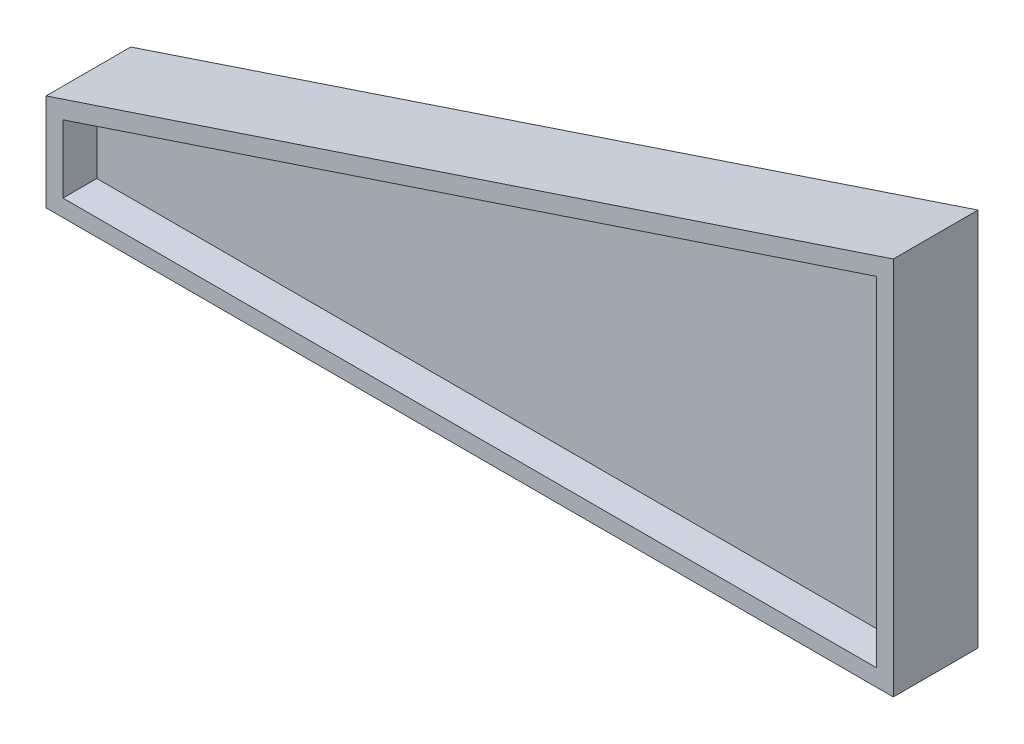
ISO-10303-21;
HEADER;
FILE_DESCRIPTION(('STEP AP214'),'2;1');
FILE_NAME('part.step','',(''),(''),'','','');
FILE_SCHEMA(('AUTOMOTIVE_DESIGN { 1 0 10303 214 1 1 1 1 }'));
ENDSEC;
DATA;
#1=APPLICATION_CONTEXT('core data for automotive mechanical design processes');
#2=APPLICATION_PROTOCOL_DEFINITION('international standard','automotive_design',2000,#1);
#3=PRODUCT_CONTEXT('',#1,'mechanical');
#4=PRODUCT('Part','Part','',(#3));
#5=PRODUCT_RELATED_PRODUCT_CATEGORY('part','',(#4));
#6=PRODUCT_DEFINITION_FORMATION('','',#4);
#7=PRODUCT_DEFINITION_CONTEXT('part definition',#1,'design');
#8=PRODUCT_DEFINITION('design','',#6,#7);
#9=PRODUCT_DEFINITION_SHAPE('','',#8);
#10=(LENGTH_UNIT() NAMED_UNIT(*) SI_UNIT(.MILLI.,.METRE.));
#11=(NAMED_UNIT(*) PLANE_ANGLE_UNIT() SI_UNIT($,.RADIAN.));
#12=(NAMED_UNIT(*) SI_UNIT($,.STERADIAN.) SOLID_ANGLE_UNIT());
#13=UNCERTAINTY_MEASURE_WITH_UNIT(LENGTH_MEASURE(1.E-05),#10,'distance_accuracy_value','');
#14=(GEOMETRIC_REPRESENTATION_CONTEXT(3) GLOBAL_UNCERTAINTY_ASSIGNED_CONTEXT((#13)) GLOBAL_UNIT_ASSIGNED_CONTEXT((#10,
#11,#12)) REPRESENTATION_CONTEXT('',''));
#15=CARTESIAN_POINT('',(0.,0.,0.));
#16=DIRECTION('',(0.,0.,1.));
#17=DIRECTION('',(1.,0.,0.));
#18=AXIS2_PLACEMENT_3D('',#15,#16,#17);
#19=CARTESIAN_POINT('',(0.,0.,12.7));
#20=DIRECTION('',(0.,0.,1.));
#21=DIRECTION('',(1.,0.,0.));
#22=AXIS2_PLACEMENT_3D('',#19,#20,#21);
#23=PLANE('',#22);
#24=DIRECTION('',(1.,0.,0.));
#25=VECTOR('',#24,1.);
#26=CARTESIAN_POINT('',(-609.6,0.,12.7));
#27=LINE('',#26,#25);
#28=CARTESIAN_POINT('',(-609.6,0.,12.7));
#29=VERTEX_POINT('',#28);
#30=CARTESIAN_POINT('',(0.,0.,12.7));
#31=VERTEX_POINT('',#30);
#32=EDGE_CURVE('E123',#29,#31,#27,.T.);
#33=ORIENTED_EDGE('',*,*,#32,.T.);
#34=DIRECTION('',(0.,1.,0.));
#35=VECTOR('',#34,1.);
#36=CARTESIAN_POINT('',(0.,0.,12.7));
#37=LINE('',#36,#35);
#38=CARTESIAN_POINT('',(0.,254.,12.7));
#39=VERTEX_POINT('',#38);
#40=EDGE_CURVE('E126',#31,#39,#37,.T.);
#41=ORIENTED_EDGE('',*,*,#40,.T.);
#42=DIRECTION('',(-0.948683298050514,-0.316227766016838,0.));
#43=VECTOR('',#42,1.);
#44=CARTESIAN_POINT('',(0.,254.,12.7));
#45=LINE('',#44,#43);
#46=CARTESIAN_POINT('',(-609.6,50.8,12.7));
#47=VERTEX_POINT('',#46);
#48=EDGE_CURVE('E43',#39,#47,#45,.T.);
#49=ORIENTED_EDGE('',*,*,#48,.T.);
#50=DIRECTION('',(0.,-1.,0.));
#51=VECTOR('',#50,1.);
#52=CARTESIAN_POINT('',(-609.6,50.8,12.7));
#53=LINE('',#52,#51);
#54=EDGE_CURVE('E11',#47,#29,#53,.T.);
#55=ORIENTED_EDGE('',*,*,#54,.T.);
#56=EDGE_LOOP('',(#33,#41,#49,#55));
#57=FACE_BOUND('',#56,.T.);
#58=ADVANCED_FACE('F33',(#57),#23,.T.);
#59=CARTESIAN_POINT('',(0.,0.,-25.4));
#60=DIRECTION('',(1.,0.,0.));
#61=DIRECTION('',(0.,0.,-1.));
#62=AXIS2_PLACEMENT_3D('',#59,#60,#61);
#63=PLANE('',#62);
#64=DIRECTION('',(0.,0.,1.));
#65=VECTOR('',#64,1.);
#66=CARTESIAN_POINT('',(0.,0.,-25.4));
#67=LINE('',#66,#65);
#68=CARTESIAN_POINT('',(0.,0.,-25.4));
#69=VERTEX_POINT('',#68);
#70=CARTESIAN_POINT('',(0.,0.,0.));
#71=VERTEX_POINT('',#70);
#72=EDGE_CURVE('E84',#69,#71,#67,.T.);
#73=ORIENTED_EDGE('',*,*,#72,.T.);
#74=DIRECTION('',(0.,1.,0.));
#75=VECTOR('',#74,1.);
#76=CARTESIAN_POINT('',(0.,0.,0.));
#77=LINE('',#76,#75);
#78=CARTESIAN_POINT('',(0.,254.,0.));
#79=VERTEX_POINT('',#78);
#80=EDGE_CURVE('E67',#71,#79,#77,.T.);
#81=ORIENTED_EDGE('',*,*,#80,.T.);
#82=DIRECTION('',(0.,0.,1.));
#83=VECTOR('',#82,1.);
#84=CARTESIAN_POINT('',(0.,254.,-25.4));
#85=LINE('',#84,#83);
#86=CARTESIAN_POINT('',(0.,254.,-25.4));
#87=VERTEX_POINT('',#86);
#88=EDGE_CURVE('E81',#87,#79,#85,.T.);
#89=ORIENTED_EDGE('',*,*,#88,.F.);
#90=DIRECTION('',(0.,1.,0.));
#91=VECTOR('',#90,1.);
#92=CARTESIAN_POINT('',(0.,0.,-25.4));
#93=LINE('',#92,#91);
#94=EDGE_CURVE('E163',#69,#87,#93,.T.);
#95=ORIENTED_EDGE('',*,*,#94,.F.);
#96=EDGE_LOOP('',(#73,#81,#89,#95));
#97=FACE_BOUND('',#96,.T.);
#98=ADVANCED_FACE('F78',(#97),#63,.F.);
#99=CARTESIAN_POINT('',(-609.6,0.,-25.4));
#100=DIRECTION('',(0.,-1.,0.));
#101=DIRECTION('',(0.,0.,-1.));
#102=AXIS2_PLACEMENT_3D('',#99,#100,#101);
#103=PLANE('',#102);
#104=DIRECTION('',(0.,0.,1.));
#105=VECTOR('',#104,1.);
#106=CARTESIAN_POINT('',(-609.6,0.,-25.4));
#107=LINE('',#106,#105);
#108=CARTESIAN_POINT('',(-609.6,0.,-25.4));
#109=VERTEX_POINT('',#108);
#110=CARTESIAN_POINT('',(-609.6,0.,0.));
#111=VERTEX_POINT('',#110);
#112=EDGE_CURVE('E137',#109,#111,#107,.T.);
#113=ORIENTED_EDGE('',*,*,#112,.T.);
#114=DIRECTION('',(1.,0.,0.));
#115=VECTOR('',#114,1.);
#116=CARTESIAN_POINT('',(-609.6,0.,0.));
#117=LINE('',#116,#115);
#118=EDGE_CURVE('E85',#111,#71,#117,.T.);
#119=ORIENTED_EDGE('',*,*,#118,.T.);
#120=ORIENTED_EDGE('',*,*,#72,.F.);
#121=DIRECTION('',(1.,0.,0.));
#122=VECTOR('',#121,1.);
#123=CARTESIAN_POINT('',(-609.6,0.,-25.4));
#124=LINE('',#123,#122);
#125=EDGE_CURVE('E96',#109,#69,#124,.T.);
#126=ORIENTED_EDGE('',*,*,#125,.F.);
#127=EDGE_LOOP('',(#113,#119,#120,#126));
#128=FACE_BOUND('',#127,.T.);
#129=ADVANCED_FACE('F133',(#128),#103,.F.);
#130=CARTESIAN_POINT('',(-609.6,50.8,-25.4));
#131=DIRECTION('',(-1.,0.,0.));
#132=DIRECTION('',(0.,0.,1.));
#133=AXIS2_PLACEMENT_3D('',#130,#131,#132);
#134=PLANE('',#133);
#135=DIRECTION('',(0.,0.,1.));
#136=VECTOR('',#135,1.);
#137=CARTESIAN_POINT('',(-609.6,50.8,-25.4));
#138=LINE('',#137,#136);
#139=CARTESIAN_POINT('',(-609.6,50.8,-25.4));
#140=VERTEX_POINT('',#139);
#141=CARTESIAN_POINT('',(-609.6,50.8,0.));
#142=VERTEX_POINT('',#141);
#143=EDGE_CURVE('E93',#140,#142,#138,.T.);
#144=ORIENTED_EDGE('',*,*,#143,.T.);
#145=DIRECTION('',(0.,-1.,0.));
#146=VECTOR('',#145,1.);
#147=CARTESIAN_POINT('',(-609.6,50.8,0.));
#148=LINE('',#147,#146);
#149=EDGE_CURVE('E37',#142,#111,#148,.T.);
#150=ORIENTED_EDGE('',*,*,#149,.T.);
#151=ORIENTED_EDGE('',*,*,#112,.F.);
#152=DIRECTION('',(0.,-1.,0.));
#153=VECTOR('',#152,1.);
#154=CARTESIAN_POINT('',(-609.6,50.8,-25.4));
#155=LINE('',#154,#153);
#156=EDGE_CURVE('E144',#140,#109,#155,.T.);
#157=ORIENTED_EDGE('',*,*,#156,.F.);
#158=EDGE_LOOP('',(#144,#150,#151,#157));
#159=FACE_BOUND('',#158,.T.);
#160=ADVANCED_FACE('F139',(#159),#134,.F.);
#161=CARTESIAN_POINT('',(0.,254.,-25.4));
#162=DIRECTION('',(-0.316227766016838,0.948683298050514,0.));
#163=DIRECTION('',(-0.948683298050514,-0.316227766016838,0.));
#164=AXIS2_PLACEMENT_3D('',#161,#162,#163);
#165=PLANE('',#164);
#166=ORIENTED_EDGE('',*,*,#88,.T.);
#167=DIRECTION('',(-0.948683298050514,-0.316227766016838,0.));
#168=VECTOR('',#167,1.);
#169=CARTESIAN_POINT('',(0.,254.,0.));
#170=LINE('',#169,#168);
#171=EDGE_CURVE('E65',#79,#142,#170,.T.);
#172=ORIENTED_EDGE('',*,*,#171,.T.);
#173=ORIENTED_EDGE('',*,*,#143,.F.);
#174=DIRECTION('',(-0.948683298050514,-0.316227766016838,0.));
#175=VECTOR('',#174,1.);
#176=CARTESIAN_POINT('',(0.,254.,-25.4));
#177=LINE('',#176,#175);
#178=EDGE_CURVE('E89',#87,#140,#177,.T.);
#179=ORIENTED_EDGE('',*,*,#178,.F.);
#180=EDGE_LOOP('',(#166,#172,#173,#179));
#181=FACE_BOUND('',#180,.T.);
#182=ADVANCED_FACE('F87',(#181),#165,.F.);
#183=CARTESIAN_POINT('',(-622.3,-12.7,-25.4));
#184=DIRECTION('',(0.,-1.,0.));
#185=DIRECTION('',(0.,0.,-1.));
#186=AXIS2_PLACEMENT_3D('',#183,#184,#185);
#187=PLANE('',#186);
#188=DIRECTION('',(0.,0.,1.));
#189=VECTOR('',#188,1.);
#190=CARTESIAN_POINT('',(12.7,-12.7,-25.4));
#191=LINE('',#190,#189);
#192=CARTESIAN_POINT('',(12.7,-12.7,-25.4));
#193=VERTEX_POINT('',#192);
#194=CARTESIAN_POINT('',(12.7,-12.7,38.1));
#195=VERTEX_POINT('',#194);
#196=EDGE_CURVE('E111',#193,#195,#191,.T.);
#197=ORIENTED_EDGE('',*,*,#196,.T.);
#198=DIRECTION('',(1.,0.,0.));
#199=VECTOR('',#198,1.);
#200=CARTESIAN_POINT('',(-622.3,-12.7,38.1));
#201=LINE('',#200,#199);
#202=CARTESIAN_POINT('',(-622.3,-12.7,38.1));
#203=VERTEX_POINT('',#202);
#204=EDGE_CURVE('E174',#203,#195,#201,.T.);
#205=ORIENTED_EDGE('',*,*,#204,.F.);
#206=DIRECTION('',(0.,0.,1.));
#207=VECTOR('',#206,1.);
#208=CARTESIAN_POINT('',(-622.3,-12.7,-25.4));
#209=LINE('',#208,#207);
#210=CARTESIAN_POINT('',(-622.3,-12.7,-25.4));
#211=VERTEX_POINT('',#210);
#212=EDGE_CURVE('E112',#211,#203,#209,.T.);
#213=ORIENTED_EDGE('',*,*,#212,.F.);
#214=DIRECTION('',(1.,0.,0.));
#215=VECTOR('',#214,1.);
#216=CARTESIAN_POINT('',(-622.3,-12.7,-25.4));
#217=LINE('',#216,#215);
#218=EDGE_CURVE('E99',#211,#193,#217,.T.);
#219=ORIENTED_EDGE('',*,*,#218,.T.);
#220=EDGE_LOOP('',(#197,#205,#213,#219));
#221=FACE_BOUND('',#220,.T.);
#222=ADVANCED_FACE('F249',(#221),#187,.T.);
#223=CARTESIAN_POINT('',(-622.3,59.9536420947128,-25.4));
#224=DIRECTION('',(-1.,0.,0.));
#225=DIRECTION('',(0.,0.,1.));
#226=AXIS2_PLACEMENT_3D('',#223,#224,#225);
#227=PLANE('',#226);
#228=ORIENTED_EDGE('',*,*,#212,.T.);
#229=DIRECTION('',(0.,-1.,0.));
#230=VECTOR('',#229,1.);
#231=CARTESIAN_POINT('',(-622.3,59.9536420947128,38.1));
#232=LINE('',#231,#230);
#233=CARTESIAN_POINT('',(-622.3,59.9536420947128,38.1));
#234=VERTEX_POINT('',#233);
#235=EDGE_CURVE('E165',#234,#203,#232,.T.);
#236=ORIENTED_EDGE('',*,*,#235,.F.);
#237=DIRECTION('',(0.,0.,1.));
#238=VECTOR('',#237,1.);
#239=CARTESIAN_POINT('',(-622.3,59.9536420947128,-25.4));
#240=LINE('',#239,#238);
#241=CARTESIAN_POINT('',(-622.3,59.9536420947128,-25.4));
#242=VERTEX_POINT('',#241);
#243=EDGE_CURVE('E115',#242,#234,#240,.T.);
#244=ORIENTED_EDGE('',*,*,#243,.F.);
#245=DIRECTION('',(0.,-1.,0.));
#246=VECTOR('',#245,1.);
#247=CARTESIAN_POINT('',(-622.3,59.9536420947128,-25.4));
#248=LINE('',#247,#246);
#249=EDGE_CURVE('E108',#242,#211,#248,.T.);
#250=ORIENTED_EDGE('',*,*,#249,.T.);
#251=EDGE_LOOP('',(#228,#236,#244,#250));
#252=FACE_BOUND('',#251,.T.);
#253=ADVANCED_FACE('F252',(#252),#227,.T.);
#254=CARTESIAN_POINT('',(12.7,271.620308761379,-25.4));
#255=DIRECTION('',(-0.316227766016838,0.948683298050514,0.));
#256=DIRECTION('',(-0.948683298050514,-0.316227766016838,0.));
#257=AXIS2_PLACEMENT_3D('',#254,#255,#256);
#258=PLANE('',#257);
#259=ORIENTED_EDGE('',*,*,#243,.T.);
#260=DIRECTION('',(-0.948683298050514,-0.316227766016838,0.));
#261=VECTOR('',#260,1.);
#262=CARTESIAN_POINT('',(12.7,271.620308761379,38.1));
#263=LINE('',#262,#261);
#264=CARTESIAN_POINT('',(12.7,271.620308761379,38.1));
#265=VERTEX_POINT('',#264);
#266=EDGE_CURVE('E168',#265,#234,#263,.T.);
#267=ORIENTED_EDGE('',*,*,#266,.F.);
#268=DIRECTION('',(0.,0.,1.));
#269=VECTOR('',#268,1.);
#270=CARTESIAN_POINT('',(12.7,271.620308761379,-25.4));
#271=LINE('',#270,#269);
#272=CARTESIAN_POINT('',(12.7,271.620308761379,-25.4));
#273=VERTEX_POINT('',#272);
#274=EDGE_CURVE('E118',#273,#265,#271,.T.);
#275=ORIENTED_EDGE('',*,*,#274,.F.);
#276=DIRECTION('',(-0.948683298050514,-0.316227766016838,0.));
#277=VECTOR('',#276,1.);
#278=CARTESIAN_POINT('',(12.7,271.620308761379,-25.4));
#279=LINE('',#278,#277);
#280=EDGE_CURVE('E105',#273,#242,#279,.T.);
#281=ORIENTED_EDGE('',*,*,#280,.T.);
#282=EDGE_LOOP('',(#259,#267,#275,#281));
#283=FACE_BOUND('',#282,.T.);
#284=ADVANCED_FACE('F258',(#283),#258,.T.);
#285=CARTESIAN_POINT('',(12.7,-12.7,-25.4));
#286=DIRECTION('',(1.,0.,0.));
#287=DIRECTION('',(0.,0.,-1.));
#288=AXIS2_PLACEMENT_3D('',#285,#286,#287);
#289=PLANE('',#288);
#290=ORIENTED_EDGE('',*,*,#274,.T.);
#291=DIRECTION('',(0.,1.,0.));
#292=VECTOR('',#291,1.);
#293=CARTESIAN_POINT('',(12.7,-12.7,38.1));
#294=LINE('',#293,#292);
#295=EDGE_CURVE('E171',#195,#265,#294,.T.);
#296=ORIENTED_EDGE('',*,*,#295,.F.);
#297=ORIENTED_EDGE('',*,*,#196,.F.);
#298=DIRECTION('',(0.,1.,0.));
#299=VECTOR('',#298,1.);
#300=CARTESIAN_POINT('',(12.7,-12.7,-25.4));
#301=LINE('',#300,#299);
#302=EDGE_CURVE('E102',#193,#273,#301,.T.);
#303=ORIENTED_EDGE('',*,*,#302,.T.);
#304=EDGE_LOOP('',(#290,#296,#297,#303));
#305=FACE_BOUND('',#304,.T.);
#306=ADVANCED_FACE('F254',(#305),#289,.T.);
#307=CARTESIAN_POINT('',(0.,0.,-25.4));
#308=DIRECTION('',(0.,0.,1.));
#309=DIRECTION('',(1.,0.,0.));
#310=AXIS2_PLACEMENT_3D('',#307,#308,#309);
#311=PLANE('',#310);
#312=ORIENTED_EDGE('',*,*,#125,.T.);
#313=ORIENTED_EDGE('',*,*,#94,.T.);
#314=ORIENTED_EDGE('',*,*,#178,.T.);
#315=ORIENTED_EDGE('',*,*,#156,.T.);
#316=EDGE_LOOP('',(#312,#313,#314,#315));
#317=FACE_BOUND('',#316,.T.);
#318=ORIENTED_EDGE('',*,*,#218,.F.);
#319=ORIENTED_EDGE('',*,*,#249,.F.);
#320=ORIENTED_EDGE('',*,*,#280,.F.);
#321=ORIENTED_EDGE('',*,*,#302,.F.);
#322=EDGE_LOOP('',(#318,#319,#320,#321));
#323=FACE_BOUND('',#322,.T.);
#324=ADVANCED_FACE('F257',(#317,#323),#311,.F.);
#325=ORIENTED_EDGE('',*,*,#40,.F.);
#326=CARTESIAN_POINT('',(0.,0.,38.1));
#327=VERTEX_POINT('',#326);
#328=EDGE_CURVE('E156',#31,#327,#67,.T.);
#329=ORIENTED_EDGE('',*,*,#328,.T.);
#330=DIRECTION('',(0.,1.,0.));
#331=VECTOR('',#330,1.);
#332=CARTESIAN_POINT('',(0.,0.,38.1));
#333=LINE('',#332,#331);
#334=CARTESIAN_POINT('',(0.,254.,38.1));
#335=VERTEX_POINT('',#334);
#336=EDGE_CURVE('E183',#327,#335,#333,.T.);
#337=ORIENTED_EDGE('',*,*,#336,.T.);
#338=EDGE_CURVE('E91',#39,#335,#85,.T.);
#339=ORIENTED_EDGE('',*,*,#338,.F.);
#340=EDGE_LOOP('',(#325,#329,#337,#339));
#341=FACE_BOUND('',#340,.T.);
#342=ADVANCED_FACE('F192',(#341),#63,.F.);
#343=ORIENTED_EDGE('',*,*,#32,.F.);
#344=CARTESIAN_POINT('',(-609.6,0.,38.1));
#345=VERTEX_POINT('',#344);
#346=EDGE_CURVE('E148',#29,#345,#107,.T.);
#347=ORIENTED_EDGE('',*,*,#346,.T.);
#348=DIRECTION('',(1.,0.,0.));
#349=VECTOR('',#348,1.);
#350=CARTESIAN_POINT('',(-609.6,0.,38.1));
#351=LINE('',#350,#349);
#352=EDGE_CURVE('E177',#345,#327,#351,.T.);
#353=ORIENTED_EDGE('',*,*,#352,.T.);
#354=ORIENTED_EDGE('',*,*,#328,.F.);
#355=EDGE_LOOP('',(#343,#347,#353,#354));
#356=FACE_BOUND('',#355,.T.);
#357=ADVANCED_FACE('F232',(#356),#103,.F.);
#358=ORIENTED_EDGE('',*,*,#54,.F.);
#359=CARTESIAN_POINT('',(-609.6,50.8,38.1));
#360=VERTEX_POINT('',#359);
#361=EDGE_CURVE('E51',#47,#360,#138,.T.);
#362=ORIENTED_EDGE('',*,*,#361,.T.);
#363=DIRECTION('',(0.,-1.,0.));
#364=VECTOR('',#363,1.);
#365=CARTESIAN_POINT('',(-609.6,50.8,38.1));
#366=LINE('',#365,#364);
#367=EDGE_CURVE('E179',#360,#345,#366,.T.);
#368=ORIENTED_EDGE('',*,*,#367,.T.);
#369=ORIENTED_EDGE('',*,*,#346,.F.);
#370=EDGE_LOOP('',(#358,#362,#368,#369));
#371=FACE_BOUND('',#370,.T.);
#372=ADVANCED_FACE('F233',(#371),#134,.F.);
#373=ORIENTED_EDGE('',*,*,#48,.F.);
#374=ORIENTED_EDGE('',*,*,#338,.T.);
#375=DIRECTION('',(-0.948683298050514,-0.316227766016838,0.));
#376=VECTOR('',#375,1.);
#377=CARTESIAN_POINT('',(0.,254.,38.1));
#378=LINE('',#377,#376);
#379=EDGE_CURVE('E181',#335,#360,#378,.T.);
#380=ORIENTED_EDGE('',*,*,#379,.T.);
#381=ORIENTED_EDGE('',*,*,#361,.F.);
#382=EDGE_LOOP('',(#373,#374,#380,#381));
#383=FACE_BOUND('',#382,.T.);
#384=ADVANCED_FACE('F201',(#383),#165,.F.);
#385=CARTESIAN_POINT('',(0.,0.,38.1));
#386=DIRECTION('',(0.,0.,1.));
#387=DIRECTION('',(1.,0.,0.));
#388=AXIS2_PLACEMENT_3D('',#385,#386,#387);
#389=PLANE('',#388);
#390=ORIENTED_EDGE('',*,*,#204,.T.);
#391=ORIENTED_EDGE('',*,*,#295,.T.);
#392=ORIENTED_EDGE('',*,*,#266,.T.);
#393=ORIENTED_EDGE('',*,*,#235,.T.);
#394=EDGE_LOOP('',(#390,#391,#392,#393));
#395=FACE_BOUND('',#394,.T.);
#396=ORIENTED_EDGE('',*,*,#379,.F.);
#397=ORIENTED_EDGE('',*,*,#336,.F.);
#398=ORIENTED_EDGE('',*,*,#352,.F.);
#399=ORIENTED_EDGE('',*,*,#367,.F.);
#400=EDGE_LOOP('',(#396,#397,#398,#399));
#401=FACE_BOUND('',#400,.T.);
#402=ADVANCED_FACE('F200',(#395,#401),#389,.T.);
#403=CARTESIAN_POINT('',(0.,0.,0.));
#404=DIRECTION('',(0.,0.,1.));
#405=DIRECTION('',(1.,0.,0.));
#406=AXIS2_PLACEMENT_3D('',#403,#404,#405);
#407=PLANE('',#406);
#408=ORIENTED_EDGE('',*,*,#118,.F.);
#409=ORIENTED_EDGE('',*,*,#149,.F.);
#410=ORIENTED_EDGE('',*,*,#171,.F.);
#411=ORIENTED_EDGE('',*,*,#80,.F.);
#412=EDGE_LOOP('',(#408,#409,#410,#411));
#413=FACE_BOUND('',#412,.T.);
#414=ADVANCED_FACE('F35',(#413),#407,.F.);
#415=CLOSED_SHELL('',(#58,#98,#129,#160,#182,#222,#253,#284,#306,#324,#342,#357,#372,#384,#402,#414));
#416=MANIFOLD_SOLID_BREP('B2',#415);
#417=ADVANCED_BREP_SHAPE_REPRESENTATION('',(#18,#416),#14);
#418=SHAPE_DEFINITION_REPRESENTATION(#9,#417);
ENDSEC;
END-ISO-10303-21;
